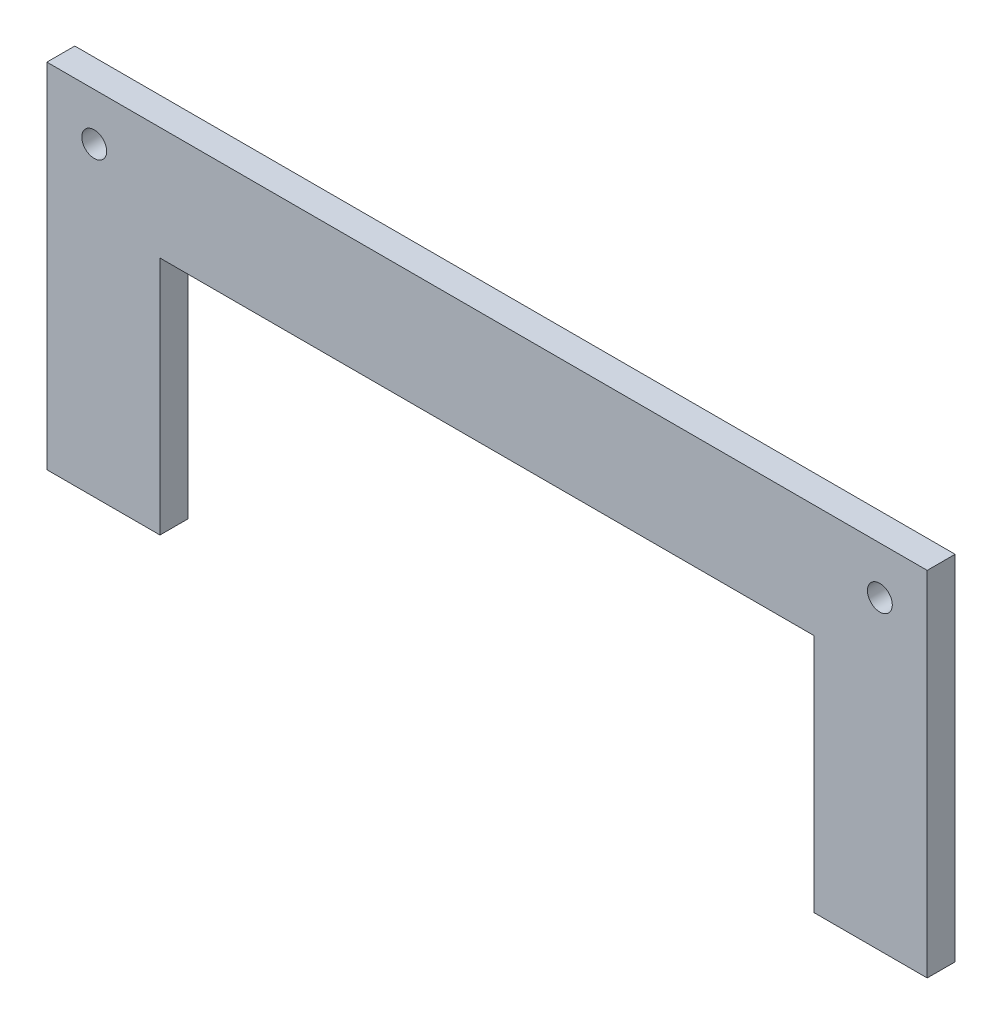
ISO-10303-21;
HEADER;
FILE_DESCRIPTION(('STEP AP214'),'2;1');
FILE_NAME('part.step','',(''),(''),'','','');
FILE_SCHEMA(('AUTOMOTIVE_DESIGN { 1 0 10303 214 1 1 1 1 }'));
ENDSEC;
DATA;
#1=APPLICATION_CONTEXT('core data for automotive mechanical design processes');
#2=APPLICATION_PROTOCOL_DEFINITION('international standard','automotive_design',2000,#1);
#3=PRODUCT_CONTEXT('',#1,'mechanical');
#4=PRODUCT('Part','Part','',(#3));
#5=PRODUCT_RELATED_PRODUCT_CATEGORY('part','',(#4));
#6=PRODUCT_DEFINITION_FORMATION('','',#4);
#7=PRODUCT_DEFINITION_CONTEXT('part definition',#1,'design');
#8=PRODUCT_DEFINITION('design','',#6,#7);
#9=PRODUCT_DEFINITION_SHAPE('','',#8);
#10=(LENGTH_UNIT() NAMED_UNIT(*) SI_UNIT(.MILLI.,.METRE.));
#11=(NAMED_UNIT(*) PLANE_ANGLE_UNIT() SI_UNIT($,.RADIAN.));
#12=(NAMED_UNIT(*) SI_UNIT($,.STERADIAN.) SOLID_ANGLE_UNIT());
#13=UNCERTAINTY_MEASURE_WITH_UNIT(LENGTH_MEASURE(1.E-05),#10,'distance_accuracy_value','');
#14=(GEOMETRIC_REPRESENTATION_CONTEXT(3) GLOBAL_UNCERTAINTY_ASSIGNED_CONTEXT((#13)) GLOBAL_UNIT_ASSIGNED_CONTEXT((#10,
#11,#12)) REPRESENTATION_CONTEXT('',''));
#15=CARTESIAN_POINT('',(0.,0.,0.));
#16=DIRECTION('',(0.,0.,1.));
#17=DIRECTION('',(1.,0.,0.));
#18=AXIS2_PLACEMENT_3D('',#15,#16,#17);
#19=CARTESIAN_POINT('',(0.,0.,3.175));
#20=DIRECTION('',(0.,0.,1.));
#21=DIRECTION('',(1.,0.,0.));
#22=AXIS2_PLACEMENT_3D('',#19,#20,#21);
#23=PLANE('',#22);
#24=CARTESIAN_POINT('',(-44.6966991411009,-5.30330085889911,3.175));
#25=DIRECTION('',(0.,0.,1.));
#26=DIRECTION('',(1.,0.,0.));
#27=AXIS2_PLACEMENT_3D('',#24,#25,#26);
#28=CIRCLE('',#27,1.415);
#29=CARTESIAN_POINT('',(-43.2816991411009,-5.30330085889911,3.175));
#30=VERTEX_POINT('',#29);
#31=EDGE_CURVE('E137',#30,#30,#28,.T.);
#32=ORIENTED_EDGE('',*,*,#31,.F.);
#33=EDGE_LOOP('',(#32));
#34=FACE_BOUND('',#33,.T.);
#35=DIRECTION('',(1.,0.,0.));
#36=VECTOR('',#35,1.);
#37=CARTESIAN_POINT('',(37.215,-40.085,3.175));
#38=LINE('',#37,#36);
#39=CARTESIAN_POINT('',(37.215,-40.085,3.175));
#40=VERTEX_POINT('',#39);
#41=CARTESIAN_POINT('',(50.085,-40.085,3.175));
#42=VERTEX_POINT('',#41);
#43=EDGE_CURVE('E148',#40,#42,#38,.T.);
#44=ORIENTED_EDGE('',*,*,#43,.T.);
#45=DIRECTION('',(0.,1.,0.));
#46=VECTOR('',#45,1.);
#47=CARTESIAN_POINT('',(50.085,-40.085,3.175));
#48=LINE('',#47,#46);
#49=CARTESIAN_POINT('',(50.085,0.085,3.175));
#50=VERTEX_POINT('',#49);
#51=EDGE_CURVE('E96',#42,#50,#48,.T.);
#52=ORIENTED_EDGE('',*,*,#51,.T.);
#53=DIRECTION('',(-1.,0.,0.));
#54=VECTOR('',#53,1.);
#55=CARTESIAN_POINT('',(-50.085,0.085,3.175));
#56=LINE('',#55,#54);
#57=CARTESIAN_POINT('',(-50.085,0.085,3.175));
#58=VERTEX_POINT('',#57);
#59=EDGE_CURVE('E163',#50,#58,#56,.T.);
#60=ORIENTED_EDGE('',*,*,#59,.T.);
#61=DIRECTION('',(0.,-1.,0.));
#62=VECTOR('',#61,1.);
#63=CARTESIAN_POINT('',(-50.085,0.085,3.175));
#64=LINE('',#63,#62);
#65=CARTESIAN_POINT('',(-50.085,-40.085,3.175));
#66=VERTEX_POINT('',#65);
#67=EDGE_CURVE('E176',#58,#66,#64,.T.);
#68=ORIENTED_EDGE('',*,*,#67,.T.);
#69=DIRECTION('',(1.,0.,0.));
#70=VECTOR('',#69,1.);
#71=CARTESIAN_POINT('',(-50.085,-40.085,3.175));
#72=LINE('',#71,#70);
#73=CARTESIAN_POINT('',(-37.215,-40.085,3.175));
#74=VERTEX_POINT('',#73);
#75=EDGE_CURVE('E115',#66,#74,#72,.T.);
#76=ORIENTED_EDGE('',*,*,#75,.T.);
#77=DIRECTION('',(0.,1.,0.));
#78=VECTOR('',#77,1.);
#79=CARTESIAN_POINT('',(-37.215,-40.085,3.175));
#80=LINE('',#79,#78);
#81=CARTESIAN_POINT('',(-37.215,-12.785,3.175));
#82=VERTEX_POINT('',#81);
#83=EDGE_CURVE('E109',#74,#82,#80,.T.);
#84=ORIENTED_EDGE('',*,*,#83,.T.);
#85=DIRECTION('',(1.,0.,0.));
#86=VECTOR('',#85,1.);
#87=CARTESIAN_POINT('',(-37.215,-12.785,3.175));
#88=LINE('',#87,#86);
#89=CARTESIAN_POINT('',(37.215,-12.785,3.175));
#90=VERTEX_POINT('',#89);
#91=EDGE_CURVE('E113',#82,#90,#88,.T.);
#92=ORIENTED_EDGE('',*,*,#91,.T.);
#93=DIRECTION('',(0.,-1.,0.));
#94=VECTOR('',#93,1.);
#95=CARTESIAN_POINT('',(37.215,-12.785,3.175));
#96=LINE('',#95,#94);
#97=EDGE_CURVE('E53',#90,#40,#96,.T.);
#98=ORIENTED_EDGE('',*,*,#97,.T.);
#99=EDGE_LOOP('',(#44,#52,#60,#68,#76,#84,#92,#98));
#100=FACE_BOUND('',#99,.T.);
#101=CARTESIAN_POINT('',(44.6966991411009,-5.30330085889911,3.175));
#102=DIRECTION('',(0.,0.,1.));
#103=DIRECTION('',(-1.,0.,0.));
#104=AXIS2_PLACEMENT_3D('',#101,#102,#103);
#105=CIRCLE('',#104,1.415);
#106=CARTESIAN_POINT('',(43.2816991411009,-5.30330085889911,3.175));
#107=VERTEX_POINT('',#106);
#108=EDGE_CURVE('E185',#107,#107,#105,.T.);
#109=ORIENTED_EDGE('',*,*,#108,.F.);
#110=EDGE_LOOP('',(#109));
#111=FACE_BOUND('',#110,.T.);
#112=ADVANCED_FACE('F36',(#34,#100,#111),#23,.T.);
#113=CARTESIAN_POINT('',(0.,0.,0.));
#114=DIRECTION('',(0.,0.,1.));
#115=DIRECTION('',(1.,0.,0.));
#116=AXIS2_PLACEMENT_3D('',#113,#114,#115);
#117=PLANE('',#116);
#118=DIRECTION('',(1.,0.,0.));
#119=VECTOR('',#118,1.);
#120=CARTESIAN_POINT('',(37.215,-40.085,0.));
#121=LINE('',#120,#119);
#122=CARTESIAN_POINT('',(37.215,-40.085,0.));
#123=VERTEX_POINT('',#122);
#124=CARTESIAN_POINT('',(50.085,-40.085,0.));
#125=VERTEX_POINT('',#124);
#126=EDGE_CURVE('E133',#123,#125,#121,.T.);
#127=ORIENTED_EDGE('',*,*,#126,.F.);
#128=DIRECTION('',(0.,-1.,0.));
#129=VECTOR('',#128,1.);
#130=CARTESIAN_POINT('',(37.215,-12.785,0.));
#131=LINE('',#130,#129);
#132=CARTESIAN_POINT('',(37.215,-12.785,0.));
#133=VERTEX_POINT('',#132);
#134=EDGE_CURVE('E88',#133,#123,#131,.T.);
#135=ORIENTED_EDGE('',*,*,#134,.F.);
#136=DIRECTION('',(1.,0.,0.));
#137=VECTOR('',#136,1.);
#138=CARTESIAN_POINT('',(-37.215,-12.785,0.));
#139=LINE('',#138,#137);
#140=CARTESIAN_POINT('',(-37.215,-12.785,0.));
#141=VERTEX_POINT('',#140);
#142=EDGE_CURVE('E82',#141,#133,#139,.T.);
#143=ORIENTED_EDGE('',*,*,#142,.F.);
#144=DIRECTION('',(0.,1.,0.));
#145=VECTOR('',#144,1.);
#146=CARTESIAN_POINT('',(-37.215,-40.085,0.));
#147=LINE('',#146,#145);
#148=CARTESIAN_POINT('',(-37.215,-40.085,0.));
#149=VERTEX_POINT('',#148);
#150=EDGE_CURVE('E123',#149,#141,#147,.T.);
#151=ORIENTED_EDGE('',*,*,#150,.F.);
#152=DIRECTION('',(1.,0.,0.));
#153=VECTOR('',#152,1.);
#154=CARTESIAN_POINT('',(-50.085,-40.085,0.));
#155=LINE('',#154,#153);
#156=CARTESIAN_POINT('',(-50.085,-40.085,0.));
#157=VERTEX_POINT('',#156);
#158=EDGE_CURVE('E143',#157,#149,#155,.T.);
#159=ORIENTED_EDGE('',*,*,#158,.F.);
#160=DIRECTION('',(0.,-1.,0.));
#161=VECTOR('',#160,1.);
#162=CARTESIAN_POINT('',(-50.085,0.085,0.));
#163=LINE('',#162,#161);
#164=CARTESIAN_POINT('',(-50.085,0.085,0.));
#165=VERTEX_POINT('',#164);
#166=EDGE_CURVE('E141',#165,#157,#163,.T.);
#167=ORIENTED_EDGE('',*,*,#166,.F.);
#168=DIRECTION('',(-1.,0.,0.));
#169=VECTOR('',#168,1.);
#170=CARTESIAN_POINT('',(-50.085,0.085,0.));
#171=LINE('',#170,#169);
#172=CARTESIAN_POINT('',(50.085,0.085,0.));
#173=VERTEX_POINT('',#172);
#174=EDGE_CURVE('E139',#173,#165,#171,.T.);
#175=ORIENTED_EDGE('',*,*,#174,.F.);
#176=DIRECTION('',(0.,1.,0.));
#177=VECTOR('',#176,1.);
#178=CARTESIAN_POINT('',(50.085,-40.085,0.));
#179=LINE('',#178,#177);
#180=EDGE_CURVE('E136',#125,#173,#179,.T.);
#181=ORIENTED_EDGE('',*,*,#180,.F.);
#182=EDGE_LOOP('',(#127,#135,#143,#151,#159,#167,#175,#181));
#183=FACE_BOUND('',#182,.T.);
#184=CARTESIAN_POINT('',(-44.6966991411009,-5.30330085889911,0.));
#185=DIRECTION('',(0.,0.,1.));
#186=DIRECTION('',(1.,0.,0.));
#187=AXIS2_PLACEMENT_3D('',#184,#185,#186);
#188=CIRCLE('',#187,1.415);
#189=CARTESIAN_POINT('',(-43.2816991411009,-5.30330085889911,0.));
#190=VERTEX_POINT('',#189);
#191=EDGE_CURVE('E182',#190,#190,#188,.T.);
#192=ORIENTED_EDGE('',*,*,#191,.T.);
#193=EDGE_LOOP('',(#192));
#194=FACE_BOUND('',#193,.T.);
#195=CARTESIAN_POINT('',(44.6966991411009,-5.30330085889911,0.));
#196=DIRECTION('',(0.,0.,1.));
#197=DIRECTION('',(-1.,0.,0.));
#198=AXIS2_PLACEMENT_3D('',#195,#196,#197);
#199=CIRCLE('',#198,1.415);
#200=CARTESIAN_POINT('',(43.2816991411009,-5.30330085889911,0.));
#201=VERTEX_POINT('',#200);
#202=EDGE_CURVE('E188',#201,#201,#199,.T.);
#203=ORIENTED_EDGE('',*,*,#202,.T.);
#204=EDGE_LOOP('',(#203));
#205=FACE_BOUND('',#204,.T.);
#206=ADVANCED_FACE('F167',(#183,#194,#205),#117,.F.);
#207=CARTESIAN_POINT('',(37.215,-40.085,3.175));
#208=DIRECTION('',(0.,1.,0.));
#209=DIRECTION('',(0.,0.,1.));
#210=AXIS2_PLACEMENT_3D('',#207,#208,#209);
#211=PLANE('',#210);
#212=ORIENTED_EDGE('',*,*,#126,.T.);
#213=DIRECTION('',(0.,0.,-1.));
#214=VECTOR('',#213,1.);
#215=CARTESIAN_POINT('',(50.085,-40.085,3.175));
#216=LINE('',#215,#214);
#217=EDGE_CURVE('E11',#42,#125,#216,.T.);
#218=ORIENTED_EDGE('',*,*,#217,.F.);
#219=ORIENTED_EDGE('',*,*,#43,.F.);
#220=DIRECTION('',(0.,0.,-1.));
#221=VECTOR('',#220,1.);
#222=CARTESIAN_POINT('',(37.215,-40.085,3.175));
#223=LINE('',#222,#221);
#224=EDGE_CURVE('E129',#40,#123,#223,.T.);
#225=ORIENTED_EDGE('',*,*,#224,.T.);
#226=EDGE_LOOP('',(#212,#218,#219,#225));
#227=FACE_BOUND('',#226,.T.);
#228=ADVANCED_FACE('F38',(#227),#211,.F.);
#229=CARTESIAN_POINT('',(50.085,-40.085,3.175));
#230=DIRECTION('',(-1.,0.,0.));
#231=DIRECTION('',(0.,0.,1.));
#232=AXIS2_PLACEMENT_3D('',#229,#230,#231);
#233=PLANE('',#232);
#234=ORIENTED_EDGE('',*,*,#180,.T.);
#235=DIRECTION('',(0.,0.,-1.));
#236=VECTOR('',#235,1.);
#237=CARTESIAN_POINT('',(50.085,0.085,3.175));
#238=LINE('',#237,#236);
#239=EDGE_CURVE('E45',#50,#173,#238,.T.);
#240=ORIENTED_EDGE('',*,*,#239,.F.);
#241=ORIENTED_EDGE('',*,*,#51,.F.);
#242=ORIENTED_EDGE('',*,*,#217,.T.);
#243=EDGE_LOOP('',(#234,#240,#241,#242));
#244=FACE_BOUND('',#243,.T.);
#245=ADVANCED_FACE('F220',(#244),#233,.F.);
#246=CARTESIAN_POINT('',(-50.085,0.085,3.175));
#247=DIRECTION('',(0.,-1.,0.));
#248=DIRECTION('',(0.,0.,-1.));
#249=AXIS2_PLACEMENT_3D('',#246,#247,#248);
#250=PLANE('',#249);
#251=ORIENTED_EDGE('',*,*,#174,.T.);
#252=DIRECTION('',(0.,0.,-1.));
#253=VECTOR('',#252,1.);
#254=CARTESIAN_POINT('',(-50.085,0.085,3.175));
#255=LINE('',#254,#253);
#256=EDGE_CURVE('E155',#58,#165,#255,.T.);
#257=ORIENTED_EDGE('',*,*,#256,.F.);
#258=ORIENTED_EDGE('',*,*,#59,.F.);
#259=ORIENTED_EDGE('',*,*,#239,.T.);
#260=EDGE_LOOP('',(#251,#257,#258,#259));
#261=FACE_BOUND('',#260,.T.);
#262=ADVANCED_FACE('F161',(#261),#250,.F.);
#263=CARTESIAN_POINT('',(-50.085,0.085,3.175));
#264=DIRECTION('',(1.,0.,0.));
#265=DIRECTION('',(0.,1.,0.));
#266=AXIS2_PLACEMENT_3D('',#263,#264,#265);
#267=PLANE('',#266);
#268=ORIENTED_EDGE('',*,*,#166,.T.);
#269=DIRECTION('',(0.,0.,-1.));
#270=VECTOR('',#269,1.);
#271=CARTESIAN_POINT('',(-50.085,-40.085,3.175));
#272=LINE('',#271,#270);
#273=EDGE_CURVE('E152',#66,#157,#272,.T.);
#274=ORIENTED_EDGE('',*,*,#273,.F.);
#275=ORIENTED_EDGE('',*,*,#67,.F.);
#276=ORIENTED_EDGE('',*,*,#256,.T.);
#277=EDGE_LOOP('',(#268,#274,#275,#276));
#278=FACE_BOUND('',#277,.T.);
#279=ADVANCED_FACE('F172',(#278),#267,.F.);
#280=CARTESIAN_POINT('',(-50.085,-40.085,3.175));
#281=DIRECTION('',(0.,1.,0.));
#282=DIRECTION('',(0.,0.,1.));
#283=AXIS2_PLACEMENT_3D('',#280,#281,#282);
#284=PLANE('',#283);
#285=ORIENTED_EDGE('',*,*,#158,.T.);
#286=DIRECTION('',(0.,0.,-1.));
#287=VECTOR('',#286,1.);
#288=CARTESIAN_POINT('',(-37.215,-40.085,3.175));
#289=LINE('',#288,#287);
#290=EDGE_CURVE('E124',#74,#149,#289,.T.);
#291=ORIENTED_EDGE('',*,*,#290,.F.);
#292=ORIENTED_EDGE('',*,*,#75,.F.);
#293=ORIENTED_EDGE('',*,*,#273,.T.);
#294=EDGE_LOOP('',(#285,#291,#292,#293));
#295=FACE_BOUND('',#294,.T.);
#296=ADVANCED_FACE('F175',(#295),#284,.F.);
#297=CARTESIAN_POINT('',(-37.215,-40.085,3.175));
#298=DIRECTION('',(-1.,0.,0.));
#299=DIRECTION('',(0.,0.,1.));
#300=AXIS2_PLACEMENT_3D('',#297,#298,#299);
#301=PLANE('',#300);
#302=ORIENTED_EDGE('',*,*,#150,.T.);
#303=DIRECTION('',(0.,0.,-1.));
#304=VECTOR('',#303,1.);
#305=CARTESIAN_POINT('',(-37.215,-12.785,3.175));
#306=LINE('',#305,#304);
#307=EDGE_CURVE('E120',#82,#141,#306,.T.);
#308=ORIENTED_EDGE('',*,*,#307,.F.);
#309=ORIENTED_EDGE('',*,*,#83,.F.);
#310=ORIENTED_EDGE('',*,*,#290,.T.);
#311=EDGE_LOOP('',(#302,#308,#309,#310));
#312=FACE_BOUND('',#311,.T.);
#313=ADVANCED_FACE('F121',(#312),#301,.F.);
#314=CARTESIAN_POINT('',(-37.215,-12.785,3.175));
#315=DIRECTION('',(0.,1.,0.));
#316=DIRECTION('',(0.,0.,1.));
#317=AXIS2_PLACEMENT_3D('',#314,#315,#316);
#318=PLANE('',#317);
#319=ORIENTED_EDGE('',*,*,#142,.T.);
#320=DIRECTION('',(0.,0.,-1.));
#321=VECTOR('',#320,1.);
#322=CARTESIAN_POINT('',(37.215,-12.785,3.175));
#323=LINE('',#322,#321);
#324=EDGE_CURVE('E125',#90,#133,#323,.T.);
#325=ORIENTED_EDGE('',*,*,#324,.F.);
#326=ORIENTED_EDGE('',*,*,#91,.F.);
#327=ORIENTED_EDGE('',*,*,#307,.T.);
#328=EDGE_LOOP('',(#319,#325,#326,#327));
#329=FACE_BOUND('',#328,.T.);
#330=ADVANCED_FACE('F127',(#329),#318,.F.);
#331=CARTESIAN_POINT('',(37.215,-12.785,3.175));
#332=DIRECTION('',(1.,0.,0.));
#333=DIRECTION('',(0.,0.,-1.));
#334=AXIS2_PLACEMENT_3D('',#331,#332,#333);
#335=PLANE('',#334);
#336=ORIENTED_EDGE('',*,*,#134,.T.);
#337=ORIENTED_EDGE('',*,*,#224,.F.);
#338=ORIENTED_EDGE('',*,*,#97,.F.);
#339=ORIENTED_EDGE('',*,*,#324,.T.);
#340=EDGE_LOOP('',(#336,#337,#338,#339));
#341=FACE_BOUND('',#340,.T.);
#342=ADVANCED_FACE('F208',(#341),#335,.F.);
#343=CARTESIAN_POINT('',(-44.6966991411009,-5.30330085889911,3.175));
#344=DIRECTION('',(0.,0.,-1.));
#345=DIRECTION('',(-1.,0.,0.));
#346=AXIS2_PLACEMENT_3D('',#343,#344,#345);
#347=CYLINDRICAL_SURFACE('',#346,1.415);
#348=ORIENTED_EDGE('',*,*,#31,.T.);
#349=EDGE_LOOP('',(#348));
#350=FACE_BOUND('',#349,.T.);
#351=ORIENTED_EDGE('',*,*,#191,.F.);
#352=EDGE_LOOP('',(#351));
#353=FACE_BOUND('',#352,.T.);
#354=ADVANCED_FACE('F205',(#350,#353),#347,.F.);
#355=CARTESIAN_POINT('',(44.6966991411009,-5.30330085889911,3.175));
#356=DIRECTION('',(0.,0.,-1.));
#357=DIRECTION('',(-1.,0.,0.));
#358=AXIS2_PLACEMENT_3D('',#355,#356,#357);
#359=CYLINDRICAL_SURFACE('',#358,1.415);
#360=ORIENTED_EDGE('',*,*,#108,.T.);
#361=EDGE_LOOP('',(#360));
#362=FACE_BOUND('',#361,.T.);
#363=ORIENTED_EDGE('',*,*,#202,.F.);
#364=EDGE_LOOP('',(#363));
#365=FACE_BOUND('',#364,.T.);
#366=ADVANCED_FACE('F194',(#362,#365),#359,.F.);
#367=CLOSED_SHELL('',(#112,#206,#228,#245,#262,#279,#296,#313,#330,#342,#354,#366));
#368=MANIFOLD_SOLID_BREP('B2',#367);
#369=ADVANCED_BREP_SHAPE_REPRESENTATION('',(#18,#368),#14);
#370=SHAPE_DEFINITION_REPRESENTATION(#9,#369);
ENDSEC;
END-ISO-10303-21;
